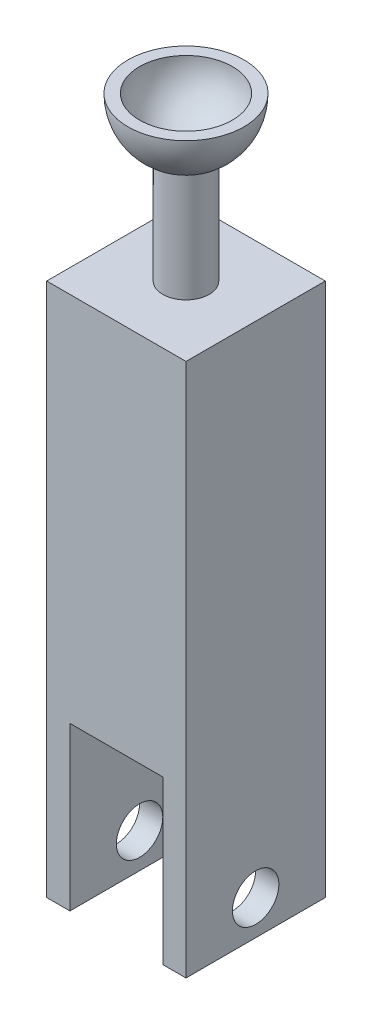
ISO-10303-21;
HEADER;
FILE_DESCRIPTION(('STEP AP214'),'2;1');
FILE_NAME('part.step','',(''),(''),'','','');
FILE_SCHEMA(('AUTOMOTIVE_DESIGN { 1 0 10303 214 1 1 1 1 }'));
ENDSEC;
DATA;
#1=APPLICATION_CONTEXT('core data for automotive mechanical design processes');
#2=APPLICATION_PROTOCOL_DEFINITION('international standard','automotive_design',2000,#1);
#3=PRODUCT_CONTEXT('',#1,'mechanical');
#4=PRODUCT('Part','Part','',(#3));
#5=PRODUCT_RELATED_PRODUCT_CATEGORY('part','',(#4));
#6=PRODUCT_DEFINITION_FORMATION('','',#4);
#7=PRODUCT_DEFINITION_CONTEXT('part definition',#1,'design');
#8=PRODUCT_DEFINITION('design','',#6,#7);
#9=PRODUCT_DEFINITION_SHAPE('','',#8);
#10=(LENGTH_UNIT() NAMED_UNIT(*) SI_UNIT(.MILLI.,.METRE.));
#11=(NAMED_UNIT(*) PLANE_ANGLE_UNIT() SI_UNIT($,.RADIAN.));
#12=(NAMED_UNIT(*) SI_UNIT($,.STERADIAN.) SOLID_ANGLE_UNIT());
#13=UNCERTAINTY_MEASURE_WITH_UNIT(LENGTH_MEASURE(1.E-05),#10,'distance_accuracy_value','');
#14=(GEOMETRIC_REPRESENTATION_CONTEXT(3) GLOBAL_UNCERTAINTY_ASSIGNED_CONTEXT((#13)) GLOBAL_UNIT_ASSIGNED_CONTEXT((#10,
#11,#12)) REPRESENTATION_CONTEXT('',''));
#15=CARTESIAN_POINT('',(0.,0.,0.));
#16=DIRECTION('',(0.,0.,1.));
#17=DIRECTION('',(1.,0.,0.));
#18=AXIS2_PLACEMENT_3D('',#15,#16,#17);
#19=CARTESIAN_POINT('',(0.,0.,0.));
#20=DIRECTION('',(0.,-1.,0.));
#21=DIRECTION('',(0.,0.,-1.));
#22=AXIS2_PLACEMENT_3D('',#19,#20,#21);
#23=PLANE('',#22);
#24=DIRECTION('',(0.,0.,1.));
#25=VECTOR('',#24,1.);
#26=CARTESIAN_POINT('',(-20.,0.,-30.));
#27=LINE('',#26,#25);
#28=CARTESIAN_POINT('',(-20.,0.,-30.));
#29=VERTEX_POINT('',#28);
#30=CARTESIAN_POINT('',(-20.,0.,30.));
#31=VERTEX_POINT('',#30);
#32=EDGE_CURVE('E154',#29,#31,#27,.T.);
#33=ORIENTED_EDGE('',*,*,#32,.T.);
#34=DIRECTION('',(1.,0.,0.));
#35=VECTOR('',#34,1.);
#36=CARTESIAN_POINT('',(-30.,0.,30.));
#37=LINE('',#36,#35);
#38=CARTESIAN_POINT('',(-30.,0.,30.));
#39=VERTEX_POINT('',#38);
#40=EDGE_CURVE('E115',#39,#31,#37,.T.);
#41=ORIENTED_EDGE('',*,*,#40,.F.);
#42=DIRECTION('',(0.,0.,1.));
#43=VECTOR('',#42,1.);
#44=CARTESIAN_POINT('',(-30.,0.,30.));
#45=LINE('',#44,#43);
#46=CARTESIAN_POINT('',(-30.,0.,-30.));
#47=VERTEX_POINT('',#46);
#48=EDGE_CURVE('E168',#47,#39,#45,.T.);
#49=ORIENTED_EDGE('',*,*,#48,.F.);
#50=DIRECTION('',(-1.,0.,0.));
#51=VECTOR('',#50,1.);
#52=CARTESIAN_POINT('',(-30.,0.,-30.));
#53=LINE('',#52,#51);
#54=EDGE_CURVE('E165',#29,#47,#53,.T.);
#55=ORIENTED_EDGE('',*,*,#54,.F.);
#56=EDGE_LOOP('',(#33,#41,#49,#55));
#57=FACE_BOUND('',#56,.T.);
#58=ADVANCED_FACE('F33',(#57),#23,.T.);
#59=CARTESIAN_POINT('',(30.,300.,30.));
#60=DIRECTION('',(-1.,0.,0.));
#61=DIRECTION('',(0.,0.,1.));
#62=AXIS2_PLACEMENT_3D('',#59,#60,#61);
#63=PLANE('',#62);
#64=CARTESIAN_POINT('',(30.,15.,0.));
#65=DIRECTION('',(1.,0.,0.));
#66=DIRECTION('',(0.,0.,-1.));
#67=AXIS2_PLACEMENT_3D('',#64,#65,#66);
#68=CIRCLE('',#67,10.);
#69=CARTESIAN_POINT('',(30.,15.,-10.));
#70=VERTEX_POINT('',#69);
#71=EDGE_CURVE('E106',#70,#70,#68,.T.);
#72=ORIENTED_EDGE('',*,*,#71,.F.);
#73=EDGE_LOOP('',(#72));
#74=FACE_BOUND('',#73,.T.);
#75=DIRECTION('',(0.,-1.,0.));
#76=VECTOR('',#75,1.);
#77=CARTESIAN_POINT('',(30.,300.,-30.));
#78=LINE('',#77,#76);
#79=CARTESIAN_POINT('',(30.,230.,-30.));
#80=VERTEX_POINT('',#79);
#81=CARTESIAN_POINT('',(30.,0.,-30.));
#82=VERTEX_POINT('',#81);
#83=EDGE_CURVE('E41',#80,#82,#78,.T.);
#84=ORIENTED_EDGE('',*,*,#83,.F.);
#85=DIRECTION('',(0.,0.,1.));
#86=VECTOR('',#85,1.);
#87=CARTESIAN_POINT('',(30.,230.,30.));
#88=LINE('',#87,#86);
#89=CARTESIAN_POINT('',(30.,230.,30.));
#90=VERTEX_POINT('',#89);
#91=EDGE_CURVE('E96',#80,#90,#88,.T.);
#92=ORIENTED_EDGE('',*,*,#91,.T.);
#93=DIRECTION('',(0.,-1.,0.));
#94=VECTOR('',#93,1.);
#95=CARTESIAN_POINT('',(30.,300.,30.));
#96=LINE('',#95,#94);
#97=CARTESIAN_POINT('',(30.,0.,30.));
#98=VERTEX_POINT('',#97);
#99=EDGE_CURVE('E104',#90,#98,#96,.T.);
#100=ORIENTED_EDGE('',*,*,#99,.T.);
#101=DIRECTION('',(0.,0.,-1.));
#102=VECTOR('',#101,1.);
#103=CARTESIAN_POINT('',(30.,0.,30.));
#104=LINE('',#103,#102);
#105=EDGE_CURVE('E157',#98,#82,#104,.T.);
#106=ORIENTED_EDGE('',*,*,#105,.T.);
#107=EDGE_LOOP('',(#84,#92,#100,#106));
#108=FACE_BOUND('',#107,.T.);
#109=ADVANCED_FACE('F35',(#74,#108),#63,.F.);
#110=CARTESIAN_POINT('',(-30.,300.,-30.));
#111=DIRECTION('',(0.,0.,1.));
#112=DIRECTION('',(1.,0.,0.));
#113=AXIS2_PLACEMENT_3D('',#110,#111,#112);
#114=PLANE('',#113);
#115=DIRECTION('',(0.,-1.,0.));
#116=VECTOR('',#115,1.);
#117=CARTESIAN_POINT('',(-30.,300.,-30.));
#118=LINE('',#117,#116);
#119=CARTESIAN_POINT('',(-30.,230.,-30.));
#120=VERTEX_POINT('',#119);
#121=EDGE_CURVE('E117',#120,#47,#118,.T.);
#122=ORIENTED_EDGE('',*,*,#121,.F.);
#123=DIRECTION('',(1.,0.,0.));
#124=VECTOR('',#123,1.);
#125=CARTESIAN_POINT('',(-30.,230.,-30.));
#126=LINE('',#125,#124);
#127=EDGE_CURVE('E107',#120,#80,#126,.T.);
#128=ORIENTED_EDGE('',*,*,#127,.T.);
#129=ORIENTED_EDGE('',*,*,#83,.T.);
#130=CARTESIAN_POINT('',(20.,0.,-30.));
#131=VERTEX_POINT('',#130);
#132=EDGE_CURVE('E166',#82,#131,#53,.T.);
#133=ORIENTED_EDGE('',*,*,#132,.T.);
#134=DIRECTION('',(0.,1.,0.));
#135=VECTOR('',#134,1.);
#136=CARTESIAN_POINT('',(20.,70.,-30.));
#137=LINE('',#136,#135);
#138=CARTESIAN_POINT('',(20.,70.,-30.));
#139=VERTEX_POINT('',#138);
#140=EDGE_CURVE('E55',#131,#139,#137,.T.);
#141=ORIENTED_EDGE('',*,*,#140,.T.);
#142=DIRECTION('',(-1.,0.,0.));
#143=VECTOR('',#142,1.);
#144=CARTESIAN_POINT('',(-20.,70.,-30.));
#145=LINE('',#144,#143);
#146=CARTESIAN_POINT('',(-20.,70.,-30.));
#147=VERTEX_POINT('',#146);
#148=EDGE_CURVE('E151',#139,#147,#145,.T.);
#149=ORIENTED_EDGE('',*,*,#148,.T.);
#150=DIRECTION('',(0.,-1.,0.));
#151=VECTOR('',#150,1.);
#152=CARTESIAN_POINT('',(-20.,70.,-30.));
#153=LINE('',#152,#151);
#154=EDGE_CURVE('E147',#147,#29,#153,.T.);
#155=ORIENTED_EDGE('',*,*,#154,.T.);
#156=ORIENTED_EDGE('',*,*,#54,.T.);
#157=EDGE_LOOP('',(#122,#128,#129,#133,#141,#149,#155,#156));
#158=FACE_BOUND('',#157,.T.);
#159=ADVANCED_FACE('F191',(#158),#114,.F.);
#160=CARTESIAN_POINT('',(-30.,300.,30.));
#161=DIRECTION('',(1.,0.,0.));
#162=DIRECTION('',(0.,0.,-1.));
#163=AXIS2_PLACEMENT_3D('',#160,#161,#162);
#164=PLANE('',#163);
#165=CARTESIAN_POINT('',(-30.,15.,0.));
#166=DIRECTION('',(1.,0.,0.));
#167=DIRECTION('',(0.,0.,-1.));
#168=AXIS2_PLACEMENT_3D('',#165,#166,#167);
#169=CIRCLE('',#168,10.);
#170=CARTESIAN_POINT('',(-30.,15.,-10.));
#171=VERTEX_POINT('',#170);
#172=EDGE_CURVE('E127',#171,#171,#169,.T.);
#173=ORIENTED_EDGE('',*,*,#172,.T.);
#174=EDGE_LOOP('',(#173));
#175=FACE_BOUND('',#174,.T.);
#176=DIRECTION('',(0.,-1.,0.));
#177=VECTOR('',#176,1.);
#178=CARTESIAN_POINT('',(-30.,300.,30.));
#179=LINE('',#178,#177);
#180=CARTESIAN_POINT('',(-30.,230.,30.));
#181=VERTEX_POINT('',#180);
#182=EDGE_CURVE('E114',#181,#39,#179,.T.);
#183=ORIENTED_EDGE('',*,*,#182,.F.);
#184=DIRECTION('',(0.,0.,-1.));
#185=VECTOR('',#184,1.);
#186=CARTESIAN_POINT('',(-30.,230.,30.));
#187=LINE('',#186,#185);
#188=EDGE_CURVE('E48',#181,#120,#187,.T.);
#189=ORIENTED_EDGE('',*,*,#188,.T.);
#190=ORIENTED_EDGE('',*,*,#121,.T.);
#191=ORIENTED_EDGE('',*,*,#48,.T.);
#192=EDGE_LOOP('',(#183,#189,#190,#191));
#193=FACE_BOUND('',#192,.T.);
#194=ADVANCED_FACE('F173',(#175,#193),#164,.F.);
#195=CARTESIAN_POINT('',(-30.,300.,30.));
#196=DIRECTION('',(0.,0.,-1.));
#197=DIRECTION('',(-1.,0.,0.));
#198=AXIS2_PLACEMENT_3D('',#195,#196,#197);
#199=PLANE('',#198);
#200=ORIENTED_EDGE('',*,*,#99,.F.);
#201=DIRECTION('',(-1.,0.,0.));
#202=VECTOR('',#201,1.);
#203=CARTESIAN_POINT('',(-30.,230.,30.));
#204=LINE('',#203,#202);
#205=EDGE_CURVE('E11',#90,#181,#204,.T.);
#206=ORIENTED_EDGE('',*,*,#205,.T.);
#207=ORIENTED_EDGE('',*,*,#182,.T.);
#208=ORIENTED_EDGE('',*,*,#40,.T.);
#209=DIRECTION('',(0.,-1.,0.));
#210=VECTOR('',#209,1.);
#211=CARTESIAN_POINT('',(-20.,70.,30.));
#212=LINE('',#211,#210);
#213=CARTESIAN_POINT('',(-20.,70.,30.));
#214=VERTEX_POINT('',#213);
#215=EDGE_CURVE('E131',#214,#31,#212,.T.);
#216=ORIENTED_EDGE('',*,*,#215,.F.);
#217=DIRECTION('',(-1.,0.,0.));
#218=VECTOR('',#217,1.);
#219=CARTESIAN_POINT('',(-20.,70.,30.));
#220=LINE('',#219,#218);
#221=CARTESIAN_POINT('',(20.,70.,30.));
#222=VERTEX_POINT('',#221);
#223=EDGE_CURVE('E144',#222,#214,#220,.T.);
#224=ORIENTED_EDGE('',*,*,#223,.F.);
#225=DIRECTION('',(0.,1.,0.));
#226=VECTOR('',#225,1.);
#227=CARTESIAN_POINT('',(20.,70.,30.));
#228=LINE('',#227,#226);
#229=CARTESIAN_POINT('',(20.,0.,30.));
#230=VERTEX_POINT('',#229);
#231=EDGE_CURVE('E141',#230,#222,#228,.T.);
#232=ORIENTED_EDGE('',*,*,#231,.F.);
#233=EDGE_CURVE('E112',#230,#98,#37,.T.);
#234=ORIENTED_EDGE('',*,*,#233,.T.);
#235=EDGE_LOOP('',(#200,#206,#207,#208,#216,#224,#232,#234));
#236=FACE_BOUND('',#235,.T.);
#237=ADVANCED_FACE('F109',(#236),#199,.F.);
#238=DIRECTION('',(0.,0.,1.));
#239=VECTOR('',#238,1.);
#240=CARTESIAN_POINT('',(20.,0.,-30.));
#241=LINE('',#240,#239);
#242=EDGE_CURVE('E160',#131,#230,#241,.T.);
#243=ORIENTED_EDGE('',*,*,#242,.F.);
#244=ORIENTED_EDGE('',*,*,#132,.F.);
#245=ORIENTED_EDGE('',*,*,#105,.F.);
#246=ORIENTED_EDGE('',*,*,#233,.F.);
#247=EDGE_LOOP('',(#243,#244,#245,#246));
#248=FACE_BOUND('',#247,.T.);
#249=ADVANCED_FACE('F188',(#248),#23,.T.);
#250=CARTESIAN_POINT('',(-20.,70.,-30.));
#251=DIRECTION('',(-1.,0.,0.));
#252=DIRECTION('',(0.,-1.,0.));
#253=AXIS2_PLACEMENT_3D('',#250,#251,#252);
#254=PLANE('',#253);
#255=CARTESIAN_POINT('',(-20.,15.,0.));
#256=DIRECTION('',(-1.,0.,0.));
#257=DIRECTION('',(0.,-1.,0.));
#258=AXIS2_PLACEMENT_3D('',#255,#256,#257);
#259=CIRCLE('',#258,10.);
#260=CARTESIAN_POINT('',(-20.,5.,0.));
#261=VERTEX_POINT('',#260);
#262=EDGE_CURVE('E126',#261,#261,#259,.T.);
#263=ORIENTED_EDGE('',*,*,#262,.T.);
#264=EDGE_LOOP('',(#263));
#265=FACE_BOUND('',#264,.T.);
#266=ORIENTED_EDGE('',*,*,#32,.F.);
#267=ORIENTED_EDGE('',*,*,#154,.F.);
#268=DIRECTION('',(0.,0.,1.));
#269=VECTOR('',#268,1.);
#270=CARTESIAN_POINT('',(-20.,70.,-30.));
#271=LINE('',#270,#269);
#272=EDGE_CURVE('E155',#147,#214,#271,.T.);
#273=ORIENTED_EDGE('',*,*,#272,.T.);
#274=ORIENTED_EDGE('',*,*,#215,.T.);
#275=EDGE_LOOP('',(#266,#267,#273,#274));
#276=FACE_BOUND('',#275,.T.);
#277=ADVANCED_FACE('F181',(#265,#276),#254,.F.);
#278=CARTESIAN_POINT('',(-20.,70.,-30.));
#279=DIRECTION('',(0.,1.,0.));
#280=DIRECTION('',(0.,0.,1.));
#281=AXIS2_PLACEMENT_3D('',#278,#279,#280);
#282=PLANE('',#281);
#283=ORIENTED_EDGE('',*,*,#272,.F.);
#284=ORIENTED_EDGE('',*,*,#148,.F.);
#285=DIRECTION('',(0.,0.,1.));
#286=VECTOR('',#285,1.);
#287=CARTESIAN_POINT('',(20.,70.,-30.));
#288=LINE('',#287,#286);
#289=EDGE_CURVE('E158',#139,#222,#288,.T.);
#290=ORIENTED_EDGE('',*,*,#289,.T.);
#291=ORIENTED_EDGE('',*,*,#223,.T.);
#292=EDGE_LOOP('',(#283,#284,#290,#291));
#293=FACE_BOUND('',#292,.T.);
#294=ADVANCED_FACE('F185',(#293),#282,.F.);
#295=CARTESIAN_POINT('',(20.,70.,-30.));
#296=DIRECTION('',(1.,0.,0.));
#297=DIRECTION('',(0.,1.,0.));
#298=AXIS2_PLACEMENT_3D('',#295,#296,#297);
#299=PLANE('',#298);
#300=CARTESIAN_POINT('',(20.,15.,0.));
#301=DIRECTION('',(1.,0.,0.));
#302=DIRECTION('',(0.,1.,0.));
#303=AXIS2_PLACEMENT_3D('',#300,#301,#302);
#304=CIRCLE('',#303,10.);
#305=CARTESIAN_POINT('',(20.,25.,0.));
#306=VERTEX_POINT('',#305);
#307=EDGE_CURVE('E124',#306,#306,#304,.T.);
#308=ORIENTED_EDGE('',*,*,#307,.T.);
#309=EDGE_LOOP('',(#308));
#310=FACE_BOUND('',#309,.T.);
#311=ORIENTED_EDGE('',*,*,#289,.F.);
#312=ORIENTED_EDGE('',*,*,#140,.F.);
#313=ORIENTED_EDGE('',*,*,#242,.T.);
#314=ORIENTED_EDGE('',*,*,#231,.T.);
#315=EDGE_LOOP('',(#311,#312,#313,#314));
#316=FACE_BOUND('',#315,.T.);
#317=ADVANCED_FACE('F186',(#310,#316),#299,.F.);
#318=CARTESIAN_POINT('',(-30.,15.,0.));
#319=DIRECTION('',(1.,0.,0.));
#320=DIRECTION('',(0.,0.,-1.));
#321=AXIS2_PLACEMENT_3D('',#318,#319,#320);
#322=CYLINDRICAL_SURFACE('',#321,10.);
#323=ORIENTED_EDGE('',*,*,#71,.T.);
#324=EDGE_LOOP('',(#323));
#325=FACE_BOUND('',#324,.T.);
#326=ORIENTED_EDGE('',*,*,#307,.F.);
#327=EDGE_LOOP('',(#326));
#328=FACE_BOUND('',#327,.T.);
#329=ADVANCED_FACE('F306',(#325,#328),#322,.F.);
#330=ORIENTED_EDGE('',*,*,#172,.F.);
#331=EDGE_LOOP('',(#330));
#332=FACE_BOUND('',#331,.T.);
#333=ORIENTED_EDGE('',*,*,#262,.F.);
#334=EDGE_LOOP('',(#333));
#335=FACE_BOUND('',#334,.T.);
#336=ADVANCED_FACE('F227',(#332,#335),#322,.F.);
#337=CARTESIAN_POINT('',(0.,230.,0.));
#338=DIRECTION('',(0.,-1.,0.));
#339=DIRECTION('',(1.,0.,0.));
#340=AXIS2_PLACEMENT_3D('',#337,#338,#339);
#341=PLANE('',#340);
#342=CARTESIAN_POINT('',(0.,230.,0.));
#343=DIRECTION('',(0.,1.,0.));
#344=DIRECTION('',(-1.,0.,0.));
#345=AXIS2_PLACEMENT_3D('',#342,#343,#344);
#346=CIRCLE('',#345,10.);
#347=CARTESIAN_POINT('',(-9.99999999999999,230.,0.));
#348=VERTEX_POINT('',#347);
#349=EDGE_CURVE('E198',#348,#348,#346,.T.);
#350=ORIENTED_EDGE('',*,*,#349,.F.);
#351=EDGE_LOOP('',(#350));
#352=FACE_BOUND('',#351,.T.);
#353=ORIENTED_EDGE('',*,*,#127,.F.);
#354=ORIENTED_EDGE('',*,*,#188,.F.);
#355=ORIENTED_EDGE('',*,*,#205,.F.);
#356=ORIENTED_EDGE('',*,*,#91,.F.);
#357=EDGE_LOOP('',(#353,#354,#355,#356));
#358=FACE_BOUND('',#357,.T.);
#359=ADVANCED_FACE('F95',(#352,#358),#341,.F.);
#360=CARTESIAN_POINT('',(0.,300.,0.));
#361=DIRECTION('',(0.,1.,0.));
#362=DIRECTION('',(-1.,0.,0.));
#363=AXIS2_PLACEMENT_3D('',#360,#361,#362);
#364=SPHERICAL_SURFACE('',#363,25.);
#365=CARTESIAN_POINT('',(0.,277.087121525221,0.));
#366=DIRECTION('',(0.,1.,0.));
#367=DIRECTION('',(-1.,0.,0.));
#368=AXIS2_PLACEMENT_3D('',#365,#366,#367);
#369=CIRCLE('',#368,10.);
#370=CARTESIAN_POINT('',(-9.99999999999999,277.087121525221,0.));
#371=VERTEX_POINT('',#370);
#372=EDGE_CURVE('E201',#371,#371,#369,.T.);
#373=ORIENTED_EDGE('',*,*,#372,.T.);
#374=EDGE_LOOP('',(#373));
#375=FACE_BOUND('',#374,.T.);
#376=CARTESIAN_POINT('',(0.,300.,0.));
#377=DIRECTION('',(0.,1.,0.));
#378=DIRECTION('',(-1.,0.,0.));
#379=AXIS2_PLACEMENT_3D('',#376,#377,#378);
#380=CIRCLE('',#379,25.);
#381=CARTESIAN_POINT('',(-25.,300.,0.));
#382=VERTEX_POINT('',#381);
#383=EDGE_CURVE('E193',#382,#382,#380,.T.);
#384=ORIENTED_EDGE('',*,*,#383,.F.);
#385=EDGE_LOOP('',(#384));
#386=FACE_BOUND('',#385,.T.);
#387=ADVANCED_FACE('F217',(#375,#386),#364,.T.);
#388=CARTESIAN_POINT('',(0.,300.,0.));
#389=DIRECTION('',(0.,1.,0.));
#390=DIRECTION('',(-1.,0.,0.));
#391=AXIS2_PLACEMENT_3D('',#388,#389,#390);
#392=CYLINDRICAL_SURFACE('',#391,10.);
#393=ORIENTED_EDGE('',*,*,#372,.F.);
#394=EDGE_LOOP('',(#393));
#395=FACE_BOUND('',#394,.T.);
#396=ORIENTED_EDGE('',*,*,#349,.T.);
#397=EDGE_LOOP('',(#396));
#398=FACE_BOUND('',#397,.T.);
#399=ADVANCED_FACE('F213',(#395,#398),#392,.T.);
#400=CARTESIAN_POINT('',(0.,300.,0.));
#401=DIRECTION('',(0.,-1.,0.));
#402=DIRECTION('',(0.,0.,-1.));
#403=AXIS2_PLACEMENT_3D('',#400,#401,#402);
#404=PLANE('',#403);
#405=CARTESIAN_POINT('',(0.,300.,0.));
#406=DIRECTION('',(0.,1.,0.));
#407=DIRECTION('',(-1.,0.,0.));
#408=AXIS2_PLACEMENT_3D('',#405,#406,#407);
#409=CIRCLE('',#408,20.);
#410=CARTESIAN_POINT('',(-20.,300.,0.));
#411=VERTEX_POINT('',#410);
#412=EDGE_CURVE('E204',#411,#411,#409,.T.);
#413=ORIENTED_EDGE('',*,*,#412,.F.);
#414=EDGE_LOOP('',(#413));
#415=FACE_BOUND('',#414,.T.);
#416=ORIENTED_EDGE('',*,*,#383,.T.);
#417=EDGE_LOOP('',(#416));
#418=FACE_BOUND('',#417,.T.);
#419=ADVANCED_FACE('F210',(#415,#418),#404,.F.);
#420=CARTESIAN_POINT('',(0.,300.,0.));
#421=DIRECTION('',(0.,1.,0.));
#422=DIRECTION('',(-1.,0.,0.));
#423=AXIS2_PLACEMENT_3D('',#420,#421,#422);
#424=SPHERICAL_SURFACE('',#423,20.);
#425=ORIENTED_EDGE('',*,*,#412,.T.);
#426=EDGE_LOOP('',(#425));
#427=FACE_BOUND('',#426,.T.);
#428=ADVANCED_FACE('F208',(#427),#424,.F.);
#429=CLOSED_SHELL('',(#58,#109,#159,#194,#237,#249,#277,#294,#317,#329,#336,#359,#387,#399,#419,#428));
#430=MANIFOLD_SOLID_BREP('B2',#429);
#431=ADVANCED_BREP_SHAPE_REPRESENTATION('',(#18,#430),#14);
#432=SHAPE_DEFINITION_REPRESENTATION(#9,#431);
ENDSEC;
END-ISO-10303-21;
